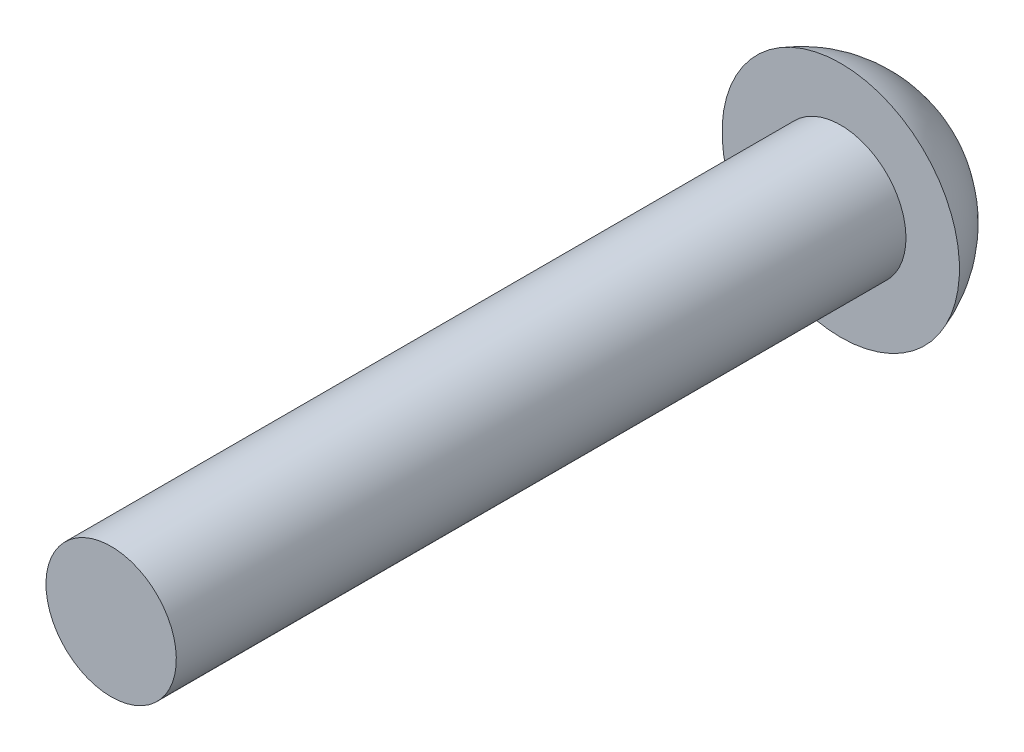
ISO-10303-21;
HEADER;
FILE_DESCRIPTION(('STEP AP214'),'2;1');
FILE_NAME('part.step','',(''),(''),'','','');
FILE_SCHEMA(('AUTOMOTIVE_DESIGN { 1 0 10303 214 1 1 1 1 }'));
ENDSEC;
DATA;
#1=APPLICATION_CONTEXT('core data for automotive mechanical design processes');
#2=APPLICATION_PROTOCOL_DEFINITION('international standard','automotive_design',2000,#1);
#3=PRODUCT_CONTEXT('',#1,'mechanical');
#4=PRODUCT('Part','Part','',(#3));
#5=PRODUCT_RELATED_PRODUCT_CATEGORY('part','',(#4));
#6=PRODUCT_DEFINITION_FORMATION('','',#4);
#7=PRODUCT_DEFINITION_CONTEXT('part definition',#1,'design');
#8=PRODUCT_DEFINITION('design','',#6,#7);
#9=PRODUCT_DEFINITION_SHAPE('','',#8);
#10=(LENGTH_UNIT() NAMED_UNIT(*) SI_UNIT(.MILLI.,.METRE.));
#11=(NAMED_UNIT(*) PLANE_ANGLE_UNIT() SI_UNIT($,.RADIAN.));
#12=(NAMED_UNIT(*) SI_UNIT($,.STERADIAN.) SOLID_ANGLE_UNIT());
#13=UNCERTAINTY_MEASURE_WITH_UNIT(LENGTH_MEASURE(1.E-05),#10,'distance_accuracy_value','');
#14=(GEOMETRIC_REPRESENTATION_CONTEXT(3) GLOBAL_UNCERTAINTY_ASSIGNED_CONTEXT((#13)) GLOBAL_UNIT_ASSIGNED_CONTEXT((#10,
#11,#12)) REPRESENTATION_CONTEXT('',''));
#15=CARTESIAN_POINT('',(0.,0.,0.));
#16=DIRECTION('',(0.,0.,1.));
#17=DIRECTION('',(1.,0.,0.));
#18=AXIS2_PLACEMENT_3D('',#15,#16,#17);
#19=CARTESIAN_POINT('',(0.,0.,-18.0195681818182));
#20=DIRECTION('',(0.,0.,1.));
#21=DIRECTION('',(0.,1.,0.));
#22=AXIS2_PLACEMENT_3D('',#19,#20,#21);
#23=SPHERICAL_SURFACE('',#22,3.26563181818182);
#24=CARTESIAN_POINT('',(0.,0.,-19.05));
#25=DIRECTION('',(0.,0.,1.));
#26=DIRECTION('',(0.,-1.,0.));
#27=AXIS2_PLACEMENT_3D('',#24,#25,#26);
#28=CIRCLE('',#27,3.0988);
#29=CARTESIAN_POINT('',(0.,-3.0988,-19.05));
#30=VERTEX_POINT('',#29);
#31=EDGE_CURVE('E10',#30,#30,#28,.T.);
#32=ORIENTED_EDGE('',*,*,#31,.F.);
#33=EDGE_LOOP('',(#32));
#34=FACE_BOUND('',#33,.T.);
#35=ADVANCED_FACE('F358',(#34),#23,.T.);
#36=CARTESIAN_POINT('',(0.,1.7018,-19.05));
#37=DIRECTION('',(0.,0.,-1.));
#38=DIRECTION('',(0.,1.,0.));
#39=AXIS2_PLACEMENT_3D('',#36,#37,#38);
#40=PLANE('',#39);
#41=CARTESIAN_POINT('',(0.,0.,-19.05));
#42=DIRECTION('',(0.,0.,1.));
#43=DIRECTION('',(0.,-1.,0.));
#44=AXIS2_PLACEMENT_3D('',#41,#42,#43);
#45=CIRCLE('',#44,1.7018);
#46=CARTESIAN_POINT('',(0.,-1.7018,-19.05));
#47=VERTEX_POINT('',#46);
#48=EDGE_CURVE('E364',#47,#47,#45,.T.);
#49=ORIENTED_EDGE('',*,*,#48,.F.);
#50=EDGE_LOOP('',(#49));
#51=FACE_BOUND('',#50,.T.);
#52=ORIENTED_EDGE('',*,*,#31,.T.);
#53=EDGE_LOOP('',(#52));
#54=FACE_BOUND('',#53,.T.);
#55=ADVANCED_FACE('F379',(#51,#54),#40,.F.);
#56=CARTESIAN_POINT('',(0.,0.,0.));
#57=DIRECTION('',(0.,0.,1.));
#58=DIRECTION('',(0.,-1.,0.));
#59=AXIS2_PLACEMENT_3D('',#56,#57,#58);
#60=CYLINDRICAL_SURFACE('',#59,1.7018);
#61=CARTESIAN_POINT('',(0.,0.,0.));
#62=DIRECTION('',(0.,0.,1.));
#63=DIRECTION('',(0.,-1.,0.));
#64=AXIS2_PLACEMENT_3D('',#61,#62,#63);
#65=CIRCLE('',#64,1.7018);
#66=CARTESIAN_POINT('',(0.,-1.7018,0.));
#67=VERTEX_POINT('',#66);
#68=EDGE_CURVE('E368',#67,#67,#65,.T.);
#69=ORIENTED_EDGE('',*,*,#68,.F.);
#70=EDGE_LOOP('',(#69));
#71=FACE_BOUND('',#70,.T.);
#72=ORIENTED_EDGE('',*,*,#48,.T.);
#73=EDGE_LOOP('',(#72));
#74=FACE_BOUND('',#73,.T.);
#75=ADVANCED_FACE('F377',(#71,#74),#60,.T.);
#76=CARTESIAN_POINT('',(0.,0.,0.));
#77=DIRECTION('',(0.,0.,-1.));
#78=DIRECTION('',(0.,1.,0.));
#79=AXIS2_PLACEMENT_3D('',#76,#77,#78);
#80=PLANE('',#79);
#81=ORIENTED_EDGE('',*,*,#68,.T.);
#82=EDGE_LOOP('',(#81));
#83=FACE_BOUND('',#82,.T.);
#84=ADVANCED_FACE('F375',(#83),#80,.F.);
#85=CLOSED_SHELL('',(#35,#55,#75,#84));
#86=MANIFOLD_SOLID_BREP('B2',#85);
#87=ADVANCED_BREP_SHAPE_REPRESENTATION('',(#18,#86),#14);
#88=SHAPE_DEFINITION_REPRESENTATION(#9,#87);
ENDSEC;
END-ISO-10303-21;
